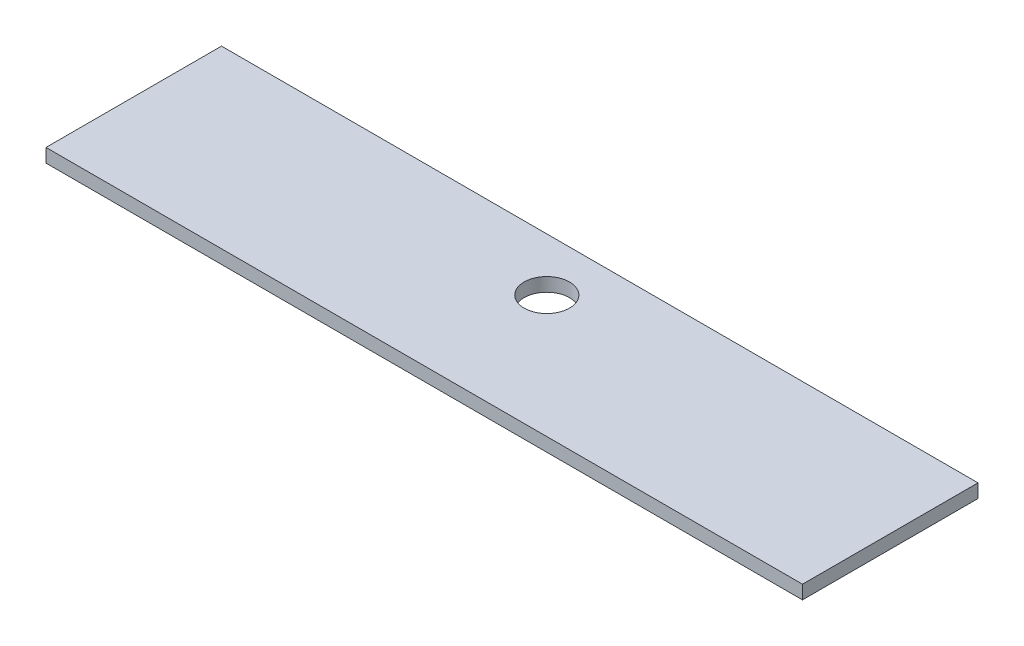
ISO-10303-21;
HEADER;
FILE_DESCRIPTION(('STEP AP214'),'2;1');
FILE_NAME('part.step','',(''),(''),'','','');
FILE_SCHEMA(('AUTOMOTIVE_DESIGN { 1 0 10303 214 1 1 1 1 }'));
ENDSEC;
DATA;
#1=APPLICATION_CONTEXT('core data for automotive mechanical design processes');
#2=APPLICATION_PROTOCOL_DEFINITION('international standard','automotive_design',2000,#1);
#3=PRODUCT_CONTEXT('',#1,'mechanical');
#4=PRODUCT('Part','Part','',(#3));
#5=PRODUCT_RELATED_PRODUCT_CATEGORY('part','',(#4));
#6=PRODUCT_DEFINITION_FORMATION('','',#4);
#7=PRODUCT_DEFINITION_CONTEXT('part definition',#1,'design');
#8=PRODUCT_DEFINITION('design','',#6,#7);
#9=PRODUCT_DEFINITION_SHAPE('','',#8);
#10=(LENGTH_UNIT() NAMED_UNIT(*) SI_UNIT(.MILLI.,.METRE.));
#11=(NAMED_UNIT(*) PLANE_ANGLE_UNIT() SI_UNIT($,.RADIAN.));
#12=(NAMED_UNIT(*) SI_UNIT($,.STERADIAN.) SOLID_ANGLE_UNIT());
#13=UNCERTAINTY_MEASURE_WITH_UNIT(LENGTH_MEASURE(1.E-05),#10,'distance_accuracy_value','');
#14=(GEOMETRIC_REPRESENTATION_CONTEXT(3) GLOBAL_UNCERTAINTY_ASSIGNED_CONTEXT((#13)) GLOBAL_UNIT_ASSIGNED_CONTEXT((#10,
#11,#12)) REPRESENTATION_CONTEXT('',''));
#15=CARTESIAN_POINT('',(0.,0.,0.));
#16=DIRECTION('',(0.,0.,1.));
#17=DIRECTION('',(1.,0.,0.));
#18=AXIS2_PLACEMENT_3D('',#15,#16,#17);
#19=CARTESIAN_POINT('',(916.474412506499,18.,-39.1177700348432));
#20=DIRECTION('',(-1.,0.,0.));
#21=DIRECTION('',(0.,0.,1.));
#22=AXIS2_PLACEMENT_3D('',#19,#20,#21);
#23=PLANE('',#22);
#24=DIRECTION('',(0.,0.,-1.));
#25=VECTOR('',#24,1.);
#26=CARTESIAN_POINT('',(916.474412506499,0.,-39.1177700348432));
#27=LINE('',#26,#25);
#28=CARTESIAN_POINT('',(916.474412506499,0.,192.882229965157));
#29=VERTEX_POINT('',#28);
#30=CARTESIAN_POINT('',(916.474412506499,0.,-39.1177700348432));
#31=VERTEX_POINT('',#30);
#32=EDGE_CURVE('E94',#29,#31,#27,.T.);
#33=ORIENTED_EDGE('',*,*,#32,.T.);
#34=DIRECTION('',(0.,-1.,0.));
#35=VECTOR('',#34,1.);
#36=CARTESIAN_POINT('',(916.474412506499,18.,-39.1177700348432));
#37=LINE('',#36,#35);
#38=CARTESIAN_POINT('',(916.474412506499,18.,-39.1177700348432));
#39=VERTEX_POINT('',#38);
#40=EDGE_CURVE('E11',#39,#31,#37,.T.);
#41=ORIENTED_EDGE('',*,*,#40,.F.);
#42=DIRECTION('',(0.,0.,-1.));
#43=VECTOR('',#42,1.);
#44=CARTESIAN_POINT('',(916.474412506499,18.,-39.1177700348432));
#45=LINE('',#44,#43);
#46=CARTESIAN_POINT('',(916.474412506499,18.,192.882229965157));
#47=VERTEX_POINT('',#46);
#48=EDGE_CURVE('E82',#47,#39,#45,.T.);
#49=ORIENTED_EDGE('',*,*,#48,.F.);
#50=DIRECTION('',(0.,-1.,0.));
#51=VECTOR('',#50,1.);
#52=CARTESIAN_POINT('',(916.474412506499,18.,192.882229965157));
#53=LINE('',#52,#51);
#54=EDGE_CURVE('E90',#47,#29,#53,.T.);
#55=ORIENTED_EDGE('',*,*,#54,.T.);
#56=EDGE_LOOP('',(#33,#41,#49,#55));
#57=FACE_BOUND('',#56,.T.);
#58=ADVANCED_FACE('F31',(#57),#23,.F.);
#59=CARTESIAN_POINT('',(-83.5255874935006,18.,-39.1177700348432));
#60=DIRECTION('',(0.,0.,1.));
#61=DIRECTION('',(1.,0.,0.));
#62=AXIS2_PLACEMENT_3D('',#59,#60,#61);
#63=PLANE('',#62);
#64=DIRECTION('',(-1.,0.,0.));
#65=VECTOR('',#64,1.);
#66=CARTESIAN_POINT('',(-83.5255874935006,0.,-39.1177700348432));
#67=LINE('',#66,#65);
#68=CARTESIAN_POINT('',(-83.5255874935006,0.,-39.1177700348432));
#69=VERTEX_POINT('',#68);
#70=EDGE_CURVE('E86',#31,#69,#67,.T.);
#71=ORIENTED_EDGE('',*,*,#70,.T.);
#72=DIRECTION('',(0.,-1.,0.));
#73=VECTOR('',#72,1.);
#74=CARTESIAN_POINT('',(-83.5255874935006,18.,-39.1177700348432));
#75=LINE('',#74,#73);
#76=CARTESIAN_POINT('',(-83.5255874935006,18.,-39.1177700348432));
#77=VERTEX_POINT('',#76);
#78=EDGE_CURVE('E39',#77,#69,#75,.T.);
#79=ORIENTED_EDGE('',*,*,#78,.F.);
#80=DIRECTION('',(-1.,0.,0.));
#81=VECTOR('',#80,1.);
#82=CARTESIAN_POINT('',(-83.5255874935006,18.,-39.1177700348432));
#83=LINE('',#82,#81);
#84=EDGE_CURVE('E77',#39,#77,#83,.T.);
#85=ORIENTED_EDGE('',*,*,#84,.F.);
#86=ORIENTED_EDGE('',*,*,#40,.T.);
#87=EDGE_LOOP('',(#71,#79,#85,#86));
#88=FACE_BOUND('',#87,.T.);
#89=ADVANCED_FACE('F85',(#88),#63,.F.);
#90=CARTESIAN_POINT('',(-83.5255874935006,18.,-39.1177700348432));
#91=DIRECTION('',(1.,0.,0.));
#92=DIRECTION('',(0.,0.,-1.));
#93=AXIS2_PLACEMENT_3D('',#90,#91,#92);
#94=PLANE('',#93);
#95=DIRECTION('',(0.,0.,1.));
#96=VECTOR('',#95,1.);
#97=CARTESIAN_POINT('',(-83.5255874935006,0.,-39.1177700348432));
#98=LINE('',#97,#96);
#99=CARTESIAN_POINT('',(-83.5255874935006,0.,192.882229965157));
#100=VERTEX_POINT('',#99);
#101=EDGE_CURVE('E64',#69,#100,#98,.T.);
#102=ORIENTED_EDGE('',*,*,#101,.T.);
#103=DIRECTION('',(0.,-1.,0.));
#104=VECTOR('',#103,1.);
#105=CARTESIAN_POINT('',(-83.5255874935006,18.,192.882229965157));
#106=LINE('',#105,#104);
#107=CARTESIAN_POINT('',(-83.5255874935006,18.,192.882229965157));
#108=VERTEX_POINT('',#107);
#109=EDGE_CURVE('E87',#108,#100,#106,.T.);
#110=ORIENTED_EDGE('',*,*,#109,.F.);
#111=DIRECTION('',(0.,0.,1.));
#112=VECTOR('',#111,1.);
#113=CARTESIAN_POINT('',(-83.5255874935006,18.,-39.1177700348432));
#114=LINE('',#113,#112);
#115=EDGE_CURVE('E80',#77,#108,#114,.T.);
#116=ORIENTED_EDGE('',*,*,#115,.F.);
#117=ORIENTED_EDGE('',*,*,#78,.T.);
#118=EDGE_LOOP('',(#102,#110,#116,#117));
#119=FACE_BOUND('',#118,.T.);
#120=ADVANCED_FACE('F88',(#119),#94,.F.);
#121=CARTESIAN_POINT('',(-83.5255874935006,18.,192.882229965157));
#122=DIRECTION('',(0.,0.,-1.));
#123=DIRECTION('',(-1.,0.,0.));
#124=AXIS2_PLACEMENT_3D('',#121,#122,#123);
#125=PLANE('',#124);
#126=DIRECTION('',(1.,0.,0.));
#127=VECTOR('',#126,1.);
#128=CARTESIAN_POINT('',(-83.5255874935006,0.,192.882229965157));
#129=LINE('',#128,#127);
#130=EDGE_CURVE('E70',#100,#29,#129,.T.);
#131=ORIENTED_EDGE('',*,*,#130,.T.);
#132=ORIENTED_EDGE('',*,*,#54,.F.);
#133=DIRECTION('',(1.,0.,0.));
#134=VECTOR('',#133,1.);
#135=CARTESIAN_POINT('',(-83.5255874935006,18.,192.882229965157));
#136=LINE('',#135,#134);
#137=EDGE_CURVE('E47',#108,#47,#136,.T.);
#138=ORIENTED_EDGE('',*,*,#137,.F.);
#139=ORIENTED_EDGE('',*,*,#109,.T.);
#140=EDGE_LOOP('',(#131,#132,#138,#139));
#141=FACE_BOUND('',#140,.T.);
#142=ADVANCED_FACE('F102',(#141),#125,.F.);
#143=CARTESIAN_POINT('',(916.474412506499,18.,192.882229965157));
#144=DIRECTION('',(0.,1.,0.));
#145=DIRECTION('',(0.,0.,1.));
#146=AXIS2_PLACEMENT_3D('',#143,#144,#145);
#147=PLANE('',#146);
#148=CARTESIAN_POINT('',(416.474412506499,18.,30.8822299651569));
#149=DIRECTION('',(0.,1.,0.));
#150=DIRECTION('',(0.,0.,1.));
#151=AXIS2_PLACEMENT_3D('',#148,#149,#150);
#152=CIRCLE('',#151,30.);
#153=CARTESIAN_POINT('',(416.474412506499,18.,60.8822299651569));
#154=VERTEX_POINT('',#153);
#155=EDGE_CURVE('E110',#154,#154,#152,.T.);
#156=ORIENTED_EDGE('',*,*,#155,.F.);
#157=EDGE_LOOP('',(#156));
#158=FACE_BOUND('',#157,.T.);
#159=ORIENTED_EDGE('',*,*,#48,.T.);
#160=ORIENTED_EDGE('',*,*,#84,.T.);
#161=ORIENTED_EDGE('',*,*,#115,.T.);
#162=ORIENTED_EDGE('',*,*,#137,.T.);
#163=EDGE_LOOP('',(#159,#160,#161,#162));
#164=FACE_BOUND('',#163,.T.);
#165=ADVANCED_FACE('F78',(#158,#164),#147,.T.);
#166=CARTESIAN_POINT('',(916.474412506499,0.,192.882229965157));
#167=DIRECTION('',(0.,1.,0.));
#168=DIRECTION('',(0.,0.,1.));
#169=AXIS2_PLACEMENT_3D('',#166,#167,#168);
#170=PLANE('',#169);
#171=CARTESIAN_POINT('',(416.474412506499,0.,30.8822299651569));
#172=DIRECTION('',(0.,1.,0.));
#173=DIRECTION('',(0.,0.,1.));
#174=AXIS2_PLACEMENT_3D('',#171,#172,#173);
#175=CIRCLE('',#174,30.);
#176=CARTESIAN_POINT('',(416.474412506499,0.,60.8822299651569));
#177=VERTEX_POINT('',#176);
#178=EDGE_CURVE('E97',#177,#177,#175,.F.);
#179=ORIENTED_EDGE('',*,*,#178,.F.);
#180=EDGE_LOOP('',(#179));
#181=FACE_BOUND('',#180,.T.);
#182=ORIENTED_EDGE('',*,*,#32,.F.);
#183=ORIENTED_EDGE('',*,*,#130,.F.);
#184=ORIENTED_EDGE('',*,*,#101,.F.);
#185=ORIENTED_EDGE('',*,*,#70,.F.);
#186=EDGE_LOOP('',(#182,#183,#184,#185));
#187=FACE_BOUND('',#186,.T.);
#188=ADVANCED_FACE('F105',(#181,#187),#170,.F.);
#189=CARTESIAN_POINT('',(416.474412506499,-84.8528137423858,30.8822299651569));
#190=DIRECTION('',(0.,1.,0.));
#191=DIRECTION('',(0.,0.,1.));
#192=AXIS2_PLACEMENT_3D('',#189,#190,#191);
#193=CYLINDRICAL_SURFACE('',#192,30.);
#194=ORIENTED_EDGE('',*,*,#178,.T.);
#195=EDGE_LOOP('',(#194));
#196=FACE_BOUND('',#195,.T.);
#197=ORIENTED_EDGE('',*,*,#155,.T.);
#198=EDGE_LOOP('',(#197));
#199=FACE_BOUND('',#198,.T.);
#200=ADVANCED_FACE('F114',(#196,#199),#193,.F.);
#201=CLOSED_SHELL('',(#58,#89,#120,#142,#165,#188,#200));
#202=MANIFOLD_SOLID_BREP('B2',#201);
#203=ADVANCED_BREP_SHAPE_REPRESENTATION('',(#18,#202),#14);
#204=SHAPE_DEFINITION_REPRESENTATION(#9,#203);
ENDSEC;
END-ISO-10303-21;
